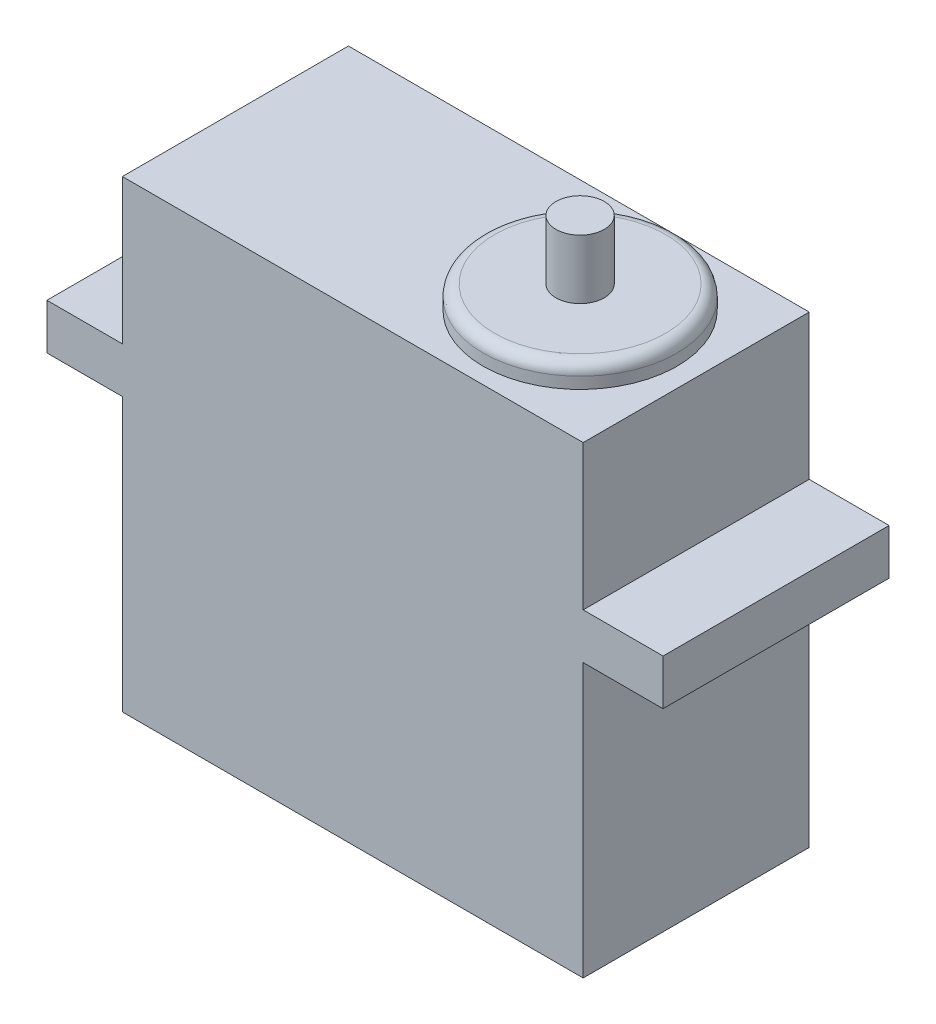
ISO-10303-21;
HEADER;
FILE_DESCRIPTION(('STEP AP214'),'2;1');
FILE_NAME('part.step','',(''),(''),'','','');
FILE_SCHEMA(('AUTOMOTIVE_DESIGN { 1 0 10303 214 1 1 1 1 }'));
ENDSEC;
DATA;
#1=APPLICATION_CONTEXT('core data for automotive mechanical design processes');
#2=APPLICATION_PROTOCOL_DEFINITION('international standard','automotive_design',2000,#1);
#3=PRODUCT_CONTEXT('',#1,'mechanical');
#4=PRODUCT('Part','Part','',(#3));
#5=PRODUCT_RELATED_PRODUCT_CATEGORY('part','',(#4));
#6=PRODUCT_DEFINITION_FORMATION('','',#4);
#7=PRODUCT_DEFINITION_CONTEXT('part definition',#1,'design');
#8=PRODUCT_DEFINITION('design','',#6,#7);
#9=PRODUCT_DEFINITION_SHAPE('','',#8);
#10=(LENGTH_UNIT() NAMED_UNIT(*) SI_UNIT(.MILLI.,.METRE.));
#11=(NAMED_UNIT(*) PLANE_ANGLE_UNIT() SI_UNIT($,.RADIAN.));
#12=(NAMED_UNIT(*) SI_UNIT($,.STERADIAN.) SOLID_ANGLE_UNIT());
#13=UNCERTAINTY_MEASURE_WITH_UNIT(LENGTH_MEASURE(1.E-05),#10,'distance_accuracy_value','');
#14=(GEOMETRIC_REPRESENTATION_CONTEXT(3) GLOBAL_UNCERTAINTY_ASSIGNED_CONTEXT((#13)) GLOBAL_UNIT_ASSIGNED_CONTEXT((#10,
#11,#12)) REPRESENTATION_CONTEXT('',''));
#15=CARTESIAN_POINT('',(0.,0.,0.));
#16=DIRECTION('',(0.,0.,1.));
#17=DIRECTION('',(1.,0.,0.));
#18=AXIS2_PLACEMENT_3D('',#15,#16,#17);
#19=CARTESIAN_POINT('',(20.193,40.64,-9.906));
#20=DIRECTION('',(-1.,0.,0.));
#21=DIRECTION('',(0.,0.,1.));
#22=AXIS2_PLACEMENT_3D('',#19,#20,#21);
#23=PLANE('',#22);
#24=DIRECTION('',(0.,-1.,0.));
#25=VECTOR('',#24,1.);
#26=CARTESIAN_POINT('',(20.193,40.64,9.906));
#27=LINE('',#26,#25);
#28=CARTESIAN_POINT('',(20.193,40.64,9.906));
#29=VERTEX_POINT('',#28);
#30=CARTESIAN_POINT('',(20.193,27.94,9.906));
#31=VERTEX_POINT('',#30);
#32=EDGE_CURVE('E209',#29,#31,#27,.T.);
#33=ORIENTED_EDGE('',*,*,#32,.T.);
#34=DIRECTION('',(0.,0.,-1.));
#35=VECTOR('',#34,1.);
#36=CARTESIAN_POINT('',(20.193,27.94,-9.906));
#37=LINE('',#36,#35);
#38=CARTESIAN_POINT('',(20.193,27.94,-9.906));
#39=VERTEX_POINT('',#38);
#40=EDGE_CURVE('E186',#31,#39,#37,.T.);
#41=ORIENTED_EDGE('',*,*,#40,.T.);
#42=DIRECTION('',(0.,-1.,0.));
#43=VECTOR('',#42,1.);
#44=CARTESIAN_POINT('',(20.193,40.64,-9.906));
#45=LINE('',#44,#43);
#46=CARTESIAN_POINT('',(20.193,40.64,-9.906));
#47=VERTEX_POINT('',#46);
#48=EDGE_CURVE('E221',#47,#39,#45,.T.);
#49=ORIENTED_EDGE('',*,*,#48,.F.);
#50=DIRECTION('',(0.,0.,-1.));
#51=VECTOR('',#50,1.);
#52=CARTESIAN_POINT('',(20.193,40.64,-9.906));
#53=LINE('',#52,#51);
#54=EDGE_CURVE('E190',#29,#47,#53,.T.);
#55=ORIENTED_EDGE('',*,*,#54,.F.);
#56=EDGE_LOOP('',(#33,#41,#49,#55));
#57=FACE_BOUND('',#56,.T.);
#58=ADVANCED_FACE('F37',(#57),#23,.F.);
#59=CARTESIAN_POINT('',(-20.193,40.64,-9.906));
#60=DIRECTION('',(1.,0.,0.));
#61=DIRECTION('',(0.,0.,-1.));
#62=AXIS2_PLACEMENT_3D('',#59,#60,#61);
#63=PLANE('',#62);
#64=DIRECTION('',(0.,-1.,0.));
#65=VECTOR('',#64,1.);
#66=CARTESIAN_POINT('',(-20.193,40.64,-9.906));
#67=LINE('',#66,#65);
#68=CARTESIAN_POINT('',(-20.193,40.64,-9.906));
#69=VERTEX_POINT('',#68);
#70=CARTESIAN_POINT('',(-20.193,27.94,-9.906));
#71=VERTEX_POINT('',#70);
#72=EDGE_CURVE('E217',#69,#71,#67,.T.);
#73=ORIENTED_EDGE('',*,*,#72,.T.);
#74=DIRECTION('',(0.,0.,1.));
#75=VECTOR('',#74,1.);
#76=CARTESIAN_POINT('',(-20.193,27.94,-9.906));
#77=LINE('',#76,#75);
#78=CARTESIAN_POINT('',(-20.193,27.94,9.906));
#79=VERTEX_POINT('',#78);
#80=EDGE_CURVE('E183',#71,#79,#77,.T.);
#81=ORIENTED_EDGE('',*,*,#80,.T.);
#82=DIRECTION('',(0.,-1.,0.));
#83=VECTOR('',#82,1.);
#84=CARTESIAN_POINT('',(-20.193,40.64,9.906));
#85=LINE('',#84,#83);
#86=CARTESIAN_POINT('',(-20.193,40.64,9.906));
#87=VERTEX_POINT('',#86);
#88=EDGE_CURVE('E213',#87,#79,#85,.T.);
#89=ORIENTED_EDGE('',*,*,#88,.F.);
#90=DIRECTION('',(0.,0.,1.));
#91=VECTOR('',#90,1.);
#92=CARTESIAN_POINT('',(-20.193,40.64,-9.906));
#93=LINE('',#92,#91);
#94=EDGE_CURVE('E196',#69,#87,#93,.T.);
#95=ORIENTED_EDGE('',*,*,#94,.F.);
#96=EDGE_LOOP('',(#73,#81,#89,#95));
#97=FACE_BOUND('',#96,.T.);
#98=ADVANCED_FACE('F248',(#97),#63,.F.);
#99=CARTESIAN_POINT('',(20.193,23.94,-9.906));
#100=VERTEX_POINT('',#99);
#101=CARTESIAN_POINT('',(20.193,0.,-9.906));
#102=VERTEX_POINT('',#101);
#103=EDGE_CURVE('E220',#100,#102,#45,.T.);
#104=ORIENTED_EDGE('',*,*,#103,.F.);
#105=DIRECTION('',(0.,0.,1.));
#106=VECTOR('',#105,1.);
#107=CARTESIAN_POINT('',(20.193,23.94,-9.906));
#108=LINE('',#107,#106);
#109=CARTESIAN_POINT('',(20.193,23.94,9.906));
#110=VERTEX_POINT('',#109);
#111=EDGE_CURVE('E181',#100,#110,#108,.T.);
#112=ORIENTED_EDGE('',*,*,#111,.T.);
#113=CARTESIAN_POINT('',(20.193,0.,9.906));
#114=VERTEX_POINT('',#113);
#115=EDGE_CURVE('E131',#110,#114,#27,.T.);
#116=ORIENTED_EDGE('',*,*,#115,.T.);
#117=DIRECTION('',(0.,0.,-1.));
#118=VECTOR('',#117,1.);
#119=CARTESIAN_POINT('',(20.193,0.,-9.906));
#120=LINE('',#119,#118);
#121=EDGE_CURVE('E189',#114,#102,#120,.T.);
#122=ORIENTED_EDGE('',*,*,#121,.T.);
#123=EDGE_LOOP('',(#104,#112,#116,#122));
#124=FACE_BOUND('',#123,.T.);
#125=ADVANCED_FACE('F263',(#124),#23,.F.);
#126=CARTESIAN_POINT('',(-20.193,40.64,-9.906));
#127=DIRECTION('',(0.,0.,1.));
#128=DIRECTION('',(1.,0.,0.));
#129=AXIS2_PLACEMENT_3D('',#126,#127,#128);
#130=PLANE('',#129);
#131=CARTESIAN_POINT('',(-20.193,23.94,-9.906));
#132=VERTEX_POINT('',#131);
#133=CARTESIAN_POINT('',(-20.193,0.,-9.906));
#134=VERTEX_POINT('',#133);
#135=EDGE_CURVE('E216',#132,#134,#67,.T.);
#136=ORIENTED_EDGE('',*,*,#135,.F.);
#137=DIRECTION('',(1.,0.,0.));
#138=VECTOR('',#137,1.);
#139=CARTESIAN_POINT('',(-26.807,23.94,-9.906));
#140=LINE('',#139,#138);
#141=CARTESIAN_POINT('',(-26.807,23.94,-9.906));
#142=VERTEX_POINT('',#141);
#143=EDGE_CURVE('E52',#142,#132,#140,.T.);
#144=ORIENTED_EDGE('',*,*,#143,.F.);
#145=DIRECTION('',(0.,1.,0.));
#146=VECTOR('',#145,1.);
#147=CARTESIAN_POINT('',(-26.807,27.94,-9.906));
#148=LINE('',#147,#146);
#149=CARTESIAN_POINT('',(-26.807,27.94,-9.906));
#150=VERTEX_POINT('',#149);
#151=EDGE_CURVE('E165',#142,#150,#148,.T.);
#152=ORIENTED_EDGE('',*,*,#151,.T.);
#153=DIRECTION('',(1.,0.,0.));
#154=VECTOR('',#153,1.);
#155=CARTESIAN_POINT('',(-26.807,27.94,-9.906));
#156=LINE('',#155,#154);
#157=EDGE_CURVE('E174',#150,#71,#156,.T.);
#158=ORIENTED_EDGE('',*,*,#157,.T.);
#159=ORIENTED_EDGE('',*,*,#72,.F.);
#160=DIRECTION('',(-1.,0.,0.));
#161=VECTOR('',#160,1.);
#162=CARTESIAN_POINT('',(-20.193,40.64,-9.906));
#163=LINE('',#162,#161);
#164=EDGE_CURVE('E193',#47,#69,#163,.T.);
#165=ORIENTED_EDGE('',*,*,#164,.F.);
#166=ORIENTED_EDGE('',*,*,#48,.T.);
#167=CARTESIAN_POINT('',(27.193,27.94,-9.906));
#168=VERTEX_POINT('',#167);
#169=EDGE_CURVE('E177',#39,#168,#156,.T.);
#170=ORIENTED_EDGE('',*,*,#169,.T.);
#171=DIRECTION('',(0.,1.,0.));
#172=VECTOR('',#171,1.);
#173=CARTESIAN_POINT('',(27.193,27.94,-9.906));
#174=LINE('',#173,#172);
#175=CARTESIAN_POINT('',(27.193,23.94,-9.906));
#176=VERTEX_POINT('',#175);
#177=EDGE_CURVE('E143',#176,#168,#174,.T.);
#178=ORIENTED_EDGE('',*,*,#177,.F.);
#179=EDGE_CURVE('E139',#100,#176,#140,.T.);
#180=ORIENTED_EDGE('',*,*,#179,.F.);
#181=ORIENTED_EDGE('',*,*,#103,.T.);
#182=DIRECTION('',(-1.,0.,0.));
#183=VECTOR('',#182,1.);
#184=CARTESIAN_POINT('',(-20.193,0.,-9.906));
#185=LINE('',#184,#183);
#186=EDGE_CURVE('E202',#102,#134,#185,.T.);
#187=ORIENTED_EDGE('',*,*,#186,.T.);
#188=EDGE_LOOP('',(#136,#144,#152,#158,#159,#165,#166,#170,#178,#180,#181,#187));
#189=FACE_BOUND('',#188,.T.);
#190=ADVANCED_FACE('F244',(#189),#130,.F.);
#191=CARTESIAN_POINT('',(-20.193,23.94,9.906));
#192=VERTEX_POINT('',#191);
#193=CARTESIAN_POINT('',(-20.193,0.,9.906));
#194=VERTEX_POINT('',#193);
#195=EDGE_CURVE('E212',#192,#194,#85,.T.);
#196=ORIENTED_EDGE('',*,*,#195,.F.);
#197=DIRECTION('',(0.,0.,-1.));
#198=VECTOR('',#197,1.);
#199=CARTESIAN_POINT('',(-20.193,23.94,-9.906));
#200=LINE('',#199,#198);
#201=EDGE_CURVE('E172',#192,#132,#200,.T.);
#202=ORIENTED_EDGE('',*,*,#201,.T.);
#203=ORIENTED_EDGE('',*,*,#135,.T.);
#204=DIRECTION('',(0.,0.,1.));
#205=VECTOR('',#204,1.);
#206=CARTESIAN_POINT('',(-20.193,0.,-9.906));
#207=LINE('',#206,#205);
#208=EDGE_CURVE('E205',#134,#194,#207,.T.);
#209=ORIENTED_EDGE('',*,*,#208,.T.);
#210=EDGE_LOOP('',(#196,#202,#203,#209));
#211=FACE_BOUND('',#210,.T.);
#212=ADVANCED_FACE('F268',(#211),#63,.F.);
#213=CARTESIAN_POINT('',(-20.193,40.64,9.906));
#214=DIRECTION('',(0.,0.,-1.));
#215=DIRECTION('',(-1.,0.,0.));
#216=AXIS2_PLACEMENT_3D('',#213,#214,#215);
#217=PLANE('',#216);
#218=ORIENTED_EDGE('',*,*,#115,.F.);
#219=DIRECTION('',(1.,0.,0.));
#220=VECTOR('',#219,1.);
#221=CARTESIAN_POINT('',(-26.807,23.94,9.906));
#222=LINE('',#221,#220);
#223=CARTESIAN_POINT('',(27.193,23.94,9.906));
#224=VERTEX_POINT('',#223);
#225=EDGE_CURVE('E60',#110,#224,#222,.T.);
#226=ORIENTED_EDGE('',*,*,#225,.T.);
#227=DIRECTION('',(0.,-1.,0.));
#228=VECTOR('',#227,1.);
#229=CARTESIAN_POINT('',(27.193,27.94,9.906));
#230=LINE('',#229,#228);
#231=CARTESIAN_POINT('',(27.193,27.94,9.906));
#232=VERTEX_POINT('',#231);
#233=EDGE_CURVE('E129',#232,#224,#230,.T.);
#234=ORIENTED_EDGE('',*,*,#233,.F.);
#235=DIRECTION('',(1.,0.,0.));
#236=VECTOR('',#235,1.);
#237=CARTESIAN_POINT('',(-26.807,27.94,9.906));
#238=LINE('',#237,#236);
#239=EDGE_CURVE('E173',#31,#232,#238,.T.);
#240=ORIENTED_EDGE('',*,*,#239,.F.);
#241=ORIENTED_EDGE('',*,*,#32,.F.);
#242=DIRECTION('',(1.,0.,0.));
#243=VECTOR('',#242,1.);
#244=CARTESIAN_POINT('',(-20.193,40.64,9.906));
#245=LINE('',#244,#243);
#246=EDGE_CURVE('E198',#87,#29,#245,.T.);
#247=ORIENTED_EDGE('',*,*,#246,.F.);
#248=ORIENTED_EDGE('',*,*,#88,.T.);
#249=CARTESIAN_POINT('',(-26.807,27.94,9.906));
#250=VERTEX_POINT('',#249);
#251=EDGE_CURVE('E170',#250,#79,#238,.T.);
#252=ORIENTED_EDGE('',*,*,#251,.F.);
#253=DIRECTION('',(0.,-1.,0.));
#254=VECTOR('',#253,1.);
#255=CARTESIAN_POINT('',(-26.807,27.94,9.906));
#256=LINE('',#255,#254);
#257=CARTESIAN_POINT('',(-26.807,23.94,9.906));
#258=VERTEX_POINT('',#257);
#259=EDGE_CURVE('E160',#250,#258,#256,.T.);
#260=ORIENTED_EDGE('',*,*,#259,.T.);
#261=EDGE_CURVE('E132',#258,#192,#222,.T.);
#262=ORIENTED_EDGE('',*,*,#261,.T.);
#263=ORIENTED_EDGE('',*,*,#195,.T.);
#264=DIRECTION('',(1.,0.,0.));
#265=VECTOR('',#264,1.);
#266=CARTESIAN_POINT('',(-20.193,0.,9.906));
#267=LINE('',#266,#265);
#268=EDGE_CURVE('E194',#194,#114,#267,.T.);
#269=ORIENTED_EDGE('',*,*,#268,.T.);
#270=EDGE_LOOP('',(#218,#226,#234,#240,#241,#247,#248,#252,#260,#262,#263,#269));
#271=FACE_BOUND('',#270,.T.);
#272=ADVANCED_FACE('F126',(#271),#217,.F.);
#273=CARTESIAN_POINT('',(0.,40.64,0.));
#274=DIRECTION('',(0.,1.,0.));
#275=DIRECTION('',(0.,0.,1.));
#276=AXIS2_PLACEMENT_3D('',#273,#274,#275);
#277=PLANE('',#276);
#278=CARTESIAN_POINT('',(10.0185719852238,40.64,0.));
#279=DIRECTION('',(0.,1.,0.));
#280=DIRECTION('',(0.,0.,1.));
#281=AXIS2_PLACEMENT_3D('',#278,#279,#280);
#282=CIRCLE('',#281,8.5);
#283=CARTESIAN_POINT('',(10.0185719852238,40.64,8.5));
#284=VERTEX_POINT('',#283);
#285=EDGE_CURVE('E155',#284,#284,#282,.T.);
#286=ORIENTED_EDGE('',*,*,#285,.F.);
#287=EDGE_LOOP('',(#286));
#288=FACE_BOUND('',#287,.T.);
#289=ORIENTED_EDGE('',*,*,#54,.T.);
#290=ORIENTED_EDGE('',*,*,#164,.T.);
#291=ORIENTED_EDGE('',*,*,#94,.T.);
#292=ORIENTED_EDGE('',*,*,#246,.T.);
#293=EDGE_LOOP('',(#289,#290,#291,#292));
#294=FACE_BOUND('',#293,.T.);
#295=ADVANCED_FACE('F231',(#288,#294),#277,.T.);
#296=CARTESIAN_POINT('',(0.,0.,0.));
#297=DIRECTION('',(0.,1.,0.));
#298=DIRECTION('',(0.,0.,1.));
#299=AXIS2_PLACEMENT_3D('',#296,#297,#298);
#300=PLANE('',#299);
#301=ORIENTED_EDGE('',*,*,#121,.F.);
#302=ORIENTED_EDGE('',*,*,#268,.F.);
#303=ORIENTED_EDGE('',*,*,#208,.F.);
#304=ORIENTED_EDGE('',*,*,#186,.F.);
#305=EDGE_LOOP('',(#301,#302,#303,#304));
#306=FACE_BOUND('',#305,.T.);
#307=ADVANCED_FACE('F234',(#306),#300,.F.);
#308=CARTESIAN_POINT('',(-26.807,0.,0.));
#309=DIRECTION('',(1.,0.,0.));
#310=DIRECTION('',(0.,0.,-1.));
#311=AXIS2_PLACEMENT_3D('',#308,#309,#310);
#312=PLANE('',#311);
#313=ORIENTED_EDGE('',*,*,#259,.F.);
#314=DIRECTION('',(0.,0.,1.));
#315=VECTOR('',#314,1.);
#316=CARTESIAN_POINT('',(-26.807,27.94,9.906));
#317=LINE('',#316,#315);
#318=EDGE_CURVE('E133',#150,#250,#317,.T.);
#319=ORIENTED_EDGE('',*,*,#318,.F.);
#320=ORIENTED_EDGE('',*,*,#151,.F.);
#321=DIRECTION('',(0.,0.,-1.));
#322=VECTOR('',#321,1.);
#323=CARTESIAN_POINT('',(-26.807,23.94,9.906));
#324=LINE('',#323,#322);
#325=EDGE_CURVE('E163',#258,#142,#324,.T.);
#326=ORIENTED_EDGE('',*,*,#325,.F.);
#327=EDGE_LOOP('',(#313,#319,#320,#326));
#328=FACE_BOUND('',#327,.T.);
#329=ADVANCED_FACE('F288',(#328),#312,.F.);
#330=CARTESIAN_POINT('',(-26.807,23.94,9.906));
#331=DIRECTION('',(0.,-1.,0.));
#332=DIRECTION('',(0.,0.,-1.));
#333=AXIS2_PLACEMENT_3D('',#330,#331,#332);
#334=PLANE('',#333);
#335=ORIENTED_EDGE('',*,*,#201,.F.);
#336=ORIENTED_EDGE('',*,*,#261,.F.);
#337=ORIENTED_EDGE('',*,*,#325,.T.);
#338=ORIENTED_EDGE('',*,*,#143,.T.);
#339=EDGE_LOOP('',(#335,#336,#337,#338));
#340=FACE_BOUND('',#339,.T.);
#341=ADVANCED_FACE('F259',(#340),#334,.T.);
#342=CARTESIAN_POINT('',(-26.807,27.94,9.906));
#343=DIRECTION('',(0.,1.,0.));
#344=DIRECTION('',(0.,0.,1.));
#345=AXIS2_PLACEMENT_3D('',#342,#343,#344);
#346=PLANE('',#345);
#347=ORIENTED_EDGE('',*,*,#80,.F.);
#348=ORIENTED_EDGE('',*,*,#157,.F.);
#349=ORIENTED_EDGE('',*,*,#318,.T.);
#350=ORIENTED_EDGE('',*,*,#251,.T.);
#351=EDGE_LOOP('',(#347,#348,#349,#350));
#352=FACE_BOUND('',#351,.T.);
#353=ADVANCED_FACE('F252',(#352),#346,.T.);
#354=ORIENTED_EDGE('',*,*,#40,.F.);
#355=ORIENTED_EDGE('',*,*,#239,.T.);
#356=DIRECTION('',(0.,0.,1.));
#357=VECTOR('',#356,1.);
#358=CARTESIAN_POINT('',(27.193,27.94,9.906));
#359=LINE('',#358,#357);
#360=EDGE_CURVE('E148',#168,#232,#359,.T.);
#361=ORIENTED_EDGE('',*,*,#360,.F.);
#362=ORIENTED_EDGE('',*,*,#169,.F.);
#363=EDGE_LOOP('',(#354,#355,#361,#362));
#364=FACE_BOUND('',#363,.T.);
#365=ADVANCED_FACE('F250',(#364),#346,.T.);
#366=ORIENTED_EDGE('',*,*,#111,.F.);
#367=ORIENTED_EDGE('',*,*,#179,.T.);
#368=DIRECTION('',(0.,0.,-1.));
#369=VECTOR('',#368,1.);
#370=CARTESIAN_POINT('',(27.193,23.94,9.906));
#371=LINE('',#370,#369);
#372=EDGE_CURVE('E136',#224,#176,#371,.T.);
#373=ORIENTED_EDGE('',*,*,#372,.F.);
#374=ORIENTED_EDGE('',*,*,#225,.F.);
#375=EDGE_LOOP('',(#366,#367,#373,#374));
#376=FACE_BOUND('',#375,.T.);
#377=ADVANCED_FACE('F137',(#376),#334,.T.);
#378=CARTESIAN_POINT('',(27.193,0.,0.));
#379=DIRECTION('',(1.,0.,0.));
#380=DIRECTION('',(0.,0.,-1.));
#381=AXIS2_PLACEMENT_3D('',#378,#379,#380);
#382=PLANE('',#381);
#383=ORIENTED_EDGE('',*,*,#233,.T.);
#384=ORIENTED_EDGE('',*,*,#372,.T.);
#385=ORIENTED_EDGE('',*,*,#177,.T.);
#386=ORIENTED_EDGE('',*,*,#360,.T.);
#387=EDGE_LOOP('',(#383,#384,#385,#386));
#388=FACE_BOUND('',#387,.T.);
#389=ADVANCED_FACE('F146',(#388),#382,.T.);
#390=CARTESIAN_POINT('',(10.0185719852238,42.64,0.));
#391=DIRECTION('',(0.,-1.,0.));
#392=DIRECTION('',(0.,0.,-1.));
#393=AXIS2_PLACEMENT_3D('',#390,#391,#392);
#394=CYLINDRICAL_SURFACE('',#393,8.5);
#395=CARTESIAN_POINT('',(10.0185719852238,41.64,0.));
#396=DIRECTION('',(0.,1.,0.));
#397=DIRECTION('',(0.,0.,1.));
#398=AXIS2_PLACEMENT_3D('',#395,#396,#397);
#399=CIRCLE('',#398,8.5);
#400=CARTESIAN_POINT('',(10.0185719852238,41.64,8.5));
#401=VERTEX_POINT('',#400);
#402=EDGE_CURVE('E11',#401,#401,#399,.F.);
#403=ORIENTED_EDGE('',*,*,#402,.T.);
#404=EDGE_LOOP('',(#403));
#405=FACE_BOUND('',#404,.T.);
#406=ORIENTED_EDGE('',*,*,#285,.T.);
#407=EDGE_LOOP('',(#406));
#408=FACE_BOUND('',#407,.T.);
#409=ADVANCED_FACE('F229',(#405,#408),#394,.T.);
#410=CARTESIAN_POINT('',(10.0185719852238,42.64,0.));
#411=DIRECTION('',(0.,1.,0.));
#412=DIRECTION('',(0.,0.,1.));
#413=AXIS2_PLACEMENT_3D('',#410,#411,#412);
#414=PLANE('',#413);
#415=CARTESIAN_POINT('',(10.0185719852238,42.64,0.));
#416=DIRECTION('',(0.,1.,0.));
#417=DIRECTION('',(0.,0.,1.));
#418=AXIS2_PLACEMENT_3D('',#415,#416,#417);
#419=CIRCLE('',#418,2.11724537292395);
#420=CARTESIAN_POINT('',(10.0185719852238,42.64,2.11724537292395));
#421=VERTEX_POINT('',#420);
#422=EDGE_CURVE('E152',#421,#421,#419,.T.);
#423=ORIENTED_EDGE('',*,*,#422,.F.);
#424=EDGE_LOOP('',(#423));
#425=FACE_BOUND('',#424,.T.);
#426=CARTESIAN_POINT('',(10.0185719852238,42.64,0.));
#427=DIRECTION('',(0.,1.,0.));
#428=DIRECTION('',(0.,0.,1.));
#429=AXIS2_PLACEMENT_3D('',#426,#427,#428);
#430=CIRCLE('',#429,7.5);
#431=CARTESIAN_POINT('',(10.0185719852238,42.64,7.5));
#432=VERTEX_POINT('',#431);
#433=EDGE_CURVE('E45',#432,#432,#430,.T.);
#434=ORIENTED_EDGE('',*,*,#433,.T.);
#435=EDGE_LOOP('',(#434));
#436=FACE_BOUND('',#435,.T.);
#437=ADVANCED_FACE('F361',(#425,#436),#414,.T.);
#438=CARTESIAN_POINT('',(10.0185719852238,41.64,0.));
#439=DIRECTION('',(0.,1.,0.));
#440=DIRECTION('',(0.,0.,1.));
#441=AXIS2_PLACEMENT_3D('',#438,#439,#440);
#442=TOROIDAL_SURFACE('',#441,7.5,1.);
#443=ORIENTED_EDGE('',*,*,#402,.F.);
#444=EDGE_LOOP('',(#443));
#445=FACE_BOUND('',#444,.T.);
#446=ORIENTED_EDGE('',*,*,#433,.F.);
#447=EDGE_LOOP('',(#446));
#448=FACE_BOUND('',#447,.T.);
#449=ADVANCED_FACE('F39',(#445,#448),#442,.T.);
#450=CARTESIAN_POINT('',(10.0185719852238,47.84,0.));
#451=DIRECTION('',(0.,-1.,0.));
#452=DIRECTION('',(0.,0.,-1.));
#453=AXIS2_PLACEMENT_3D('',#450,#451,#452);
#454=CYLINDRICAL_SURFACE('',#453,2.11724537292395);
#455=CARTESIAN_POINT('',(10.0185719852238,47.84,0.));
#456=DIRECTION('',(0.,1.,0.));
#457=DIRECTION('',(0.,0.,1.));
#458=AXIS2_PLACEMENT_3D('',#455,#456,#457);
#459=CIRCLE('',#458,2.11724537292395);
#460=CARTESIAN_POINT('',(10.0185719852238,47.84,2.11724537292395));
#461=VERTEX_POINT('',#460);
#462=EDGE_CURVE('E149',#461,#461,#459,.T.);
#463=ORIENTED_EDGE('',*,*,#462,.F.);
#464=EDGE_LOOP('',(#463));
#465=FACE_BOUND('',#464,.T.);
#466=ORIENTED_EDGE('',*,*,#422,.T.);
#467=EDGE_LOOP('',(#466));
#468=FACE_BOUND('',#467,.T.);
#469=ADVANCED_FACE('F376',(#465,#468),#454,.T.);
#470=CARTESIAN_POINT('',(10.0185719852238,47.84,0.));
#471=DIRECTION('',(0.,1.,0.));
#472=DIRECTION('',(0.,0.,1.));
#473=AXIS2_PLACEMENT_3D('',#470,#471,#472);
#474=PLANE('',#473);
#475=ORIENTED_EDGE('',*,*,#462,.T.);
#476=EDGE_LOOP('',(#475));
#477=FACE_BOUND('',#476,.T.);
#478=ADVANCED_FACE('F382',(#477),#474,.T.);
#479=CLOSED_SHELL('',(#58,#98,#125,#190,#212,#272,#295,#307,#329,#341,#353,#365,#377,#389,#409,
#437,#449,#469,#478));
#480=MANIFOLD_SOLID_BREP('B2',#479);
#481=ADVANCED_BREP_SHAPE_REPRESENTATION('',(#18,#480),#14);
#482=SHAPE_DEFINITION_REPRESENTATION(#9,#481);
ENDSEC;
END-ISO-10303-21;
